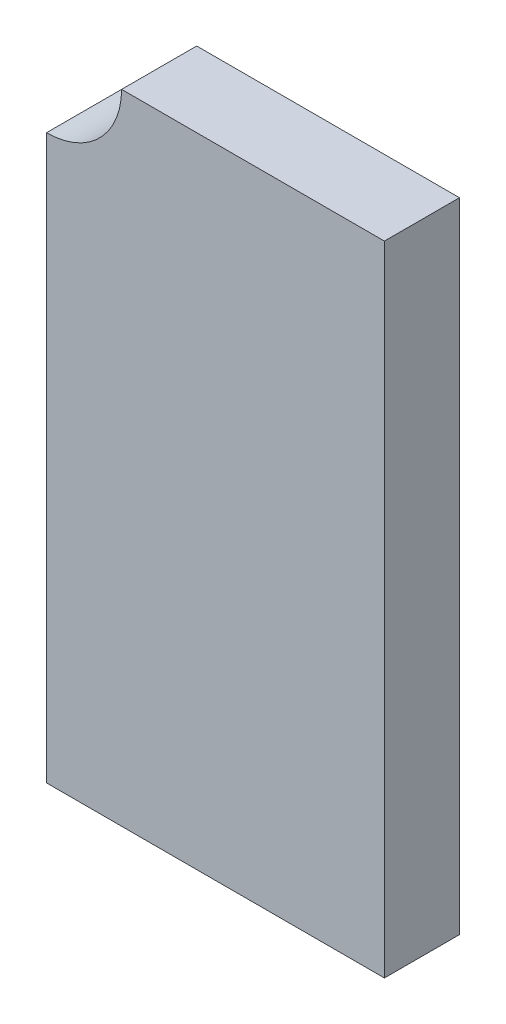
ISO-10303-21;
HEADER;
FILE_DESCRIPTION(('STEP AP214'),'2;1');
FILE_NAME('part.step','',(''),(''),'','','');
FILE_SCHEMA(('AUTOMOTIVE_DESIGN { 1 0 10303 214 1 1 1 1 }'));
ENDSEC;
DATA;
#1=APPLICATION_CONTEXT('core data for automotive mechanical design processes');
#2=APPLICATION_PROTOCOL_DEFINITION('international standard','automotive_design',2000,#1);
#3=PRODUCT_CONTEXT('',#1,'mechanical');
#4=PRODUCT('Part','Part','',(#3));
#5=PRODUCT_RELATED_PRODUCT_CATEGORY('part','',(#4));
#6=PRODUCT_DEFINITION_FORMATION('','',#4);
#7=PRODUCT_DEFINITION_CONTEXT('part definition',#1,'design');
#8=PRODUCT_DEFINITION('design','',#6,#7);
#9=PRODUCT_DEFINITION_SHAPE('','',#8);
#10=(LENGTH_UNIT() NAMED_UNIT(*) SI_UNIT(.MILLI.,.METRE.));
#11=(NAMED_UNIT(*) PLANE_ANGLE_UNIT() SI_UNIT($,.RADIAN.));
#12=(NAMED_UNIT(*) SI_UNIT($,.STERADIAN.) SOLID_ANGLE_UNIT());
#13=UNCERTAINTY_MEASURE_WITH_UNIT(LENGTH_MEASURE(1.E-05),#10,'distance_accuracy_value','');
#14=(GEOMETRIC_REPRESENTATION_CONTEXT(3) GLOBAL_UNCERTAINTY_ASSIGNED_CONTEXT((#13)) GLOBAL_UNIT_ASSIGNED_CONTEXT((#10,
#11,#12)) REPRESENTATION_CONTEXT('',''));
#15=CARTESIAN_POINT('',(0.,0.,0.));
#16=DIRECTION('',(0.,0.,1.));
#17=DIRECTION('',(1.,0.,0.));
#18=AXIS2_PLACEMENT_3D('',#15,#16,#17);
#19=CARTESIAN_POINT('',(-0.45,0.85,0.));
#20=DIRECTION('',(0.,0.,1.));
#21=DIRECTION('',(1.,0.,0.));
#22=AXIS2_PLACEMENT_3D('',#19,#20,#21);
#23=CYLINDRICAL_SURFACE('',#22,0.2);
#24=DIRECTION('',(0.,0.,1.));
#25=VECTOR('',#24,1.);
#26=CARTESIAN_POINT('',(-0.25,0.85,0.));
#27=LINE('',#26,#25);
#28=CARTESIAN_POINT('',(-0.25,0.85,0.));
#29=VERTEX_POINT('',#28);
#30=CARTESIAN_POINT('',(-0.25,0.85,0.2));
#31=VERTEX_POINT('',#30);
#32=EDGE_CURVE('E11',#29,#31,#27,.T.);
#33=ORIENTED_EDGE('',*,*,#32,.F.);
#34=CARTESIAN_POINT('',(-0.45,0.85,0.));
#35=DIRECTION('',(0.,0.,1.));
#36=DIRECTION('',(1.,0.,0.));
#37=AXIS2_PLACEMENT_3D('',#34,#35,#36);
#38=CIRCLE('',#37,0.2);
#39=CARTESIAN_POINT('',(-0.45,0.65,0.));
#40=VERTEX_POINT('',#39);
#41=EDGE_CURVE('E24',#40,#29,#38,.T.);
#42=ORIENTED_EDGE('',*,*,#41,.F.);
#43=DIRECTION('',(0.,0.,-1.));
#44=VECTOR('',#43,1.);
#45=CARTESIAN_POINT('',(-0.45,0.65,0.));
#46=LINE('',#45,#44);
#47=CARTESIAN_POINT('',(-0.45,0.65,0.2));
#48=VERTEX_POINT('',#47);
#49=EDGE_CURVE('E101',#48,#40,#46,.T.);
#50=ORIENTED_EDGE('',*,*,#49,.F.);
#51=CARTESIAN_POINT('',(-0.45,0.85,0.2));
#52=DIRECTION('',(0.,0.,-1.));
#53=DIRECTION('',(1.,0.,0.));
#54=AXIS2_PLACEMENT_3D('',#51,#52,#53);
#55=CIRCLE('',#54,0.2);
#56=EDGE_CURVE('E37',#31,#48,#55,.T.);
#57=ORIENTED_EDGE('',*,*,#56,.F.);
#58=EDGE_LOOP('',(#33,#42,#50,#57));
#59=FACE_BOUND('',#58,.T.);
#60=ADVANCED_FACE('F17',(#59),#23,.F.);
#61=CARTESIAN_POINT('',(0.,0.,0.2));
#62=DIRECTION('',(0.,0.,1.));
#63=DIRECTION('',(1.,0.,0.));
#64=AXIS2_PLACEMENT_3D('',#61,#62,#63);
#65=PLANE('',#64);
#66=ORIENTED_EDGE('',*,*,#56,.T.);
#67=DIRECTION('',(0.,-1.,0.));
#68=VECTOR('',#67,1.);
#69=CARTESIAN_POINT('',(-0.45,0.85,0.2));
#70=LINE('',#69,#68);
#71=CARTESIAN_POINT('',(-0.45,-0.85,0.2));
#72=VERTEX_POINT('',#71);
#73=EDGE_CURVE('E98',#48,#72,#70,.T.);
#74=ORIENTED_EDGE('',*,*,#73,.T.);
#75=DIRECTION('',(1.,0.,0.));
#76=VECTOR('',#75,1.);
#77=CARTESIAN_POINT('',(-0.45,-0.85,0.2));
#78=LINE('',#77,#76);
#79=CARTESIAN_POINT('',(0.45,-0.85,0.2));
#80=VERTEX_POINT('',#79);
#81=EDGE_CURVE('E96',#72,#80,#78,.T.);
#82=ORIENTED_EDGE('',*,*,#81,.T.);
#83=DIRECTION('',(0.,1.,0.));
#84=VECTOR('',#83,1.);
#85=CARTESIAN_POINT('',(0.45,-0.85,0.2));
#86=LINE('',#85,#84);
#87=CARTESIAN_POINT('',(0.45,0.85,0.2));
#88=VERTEX_POINT('',#87);
#89=EDGE_CURVE('E84',#80,#88,#86,.T.);
#90=ORIENTED_EDGE('',*,*,#89,.T.);
#91=DIRECTION('',(-1.,0.,0.));
#92=VECTOR('',#91,1.);
#93=CARTESIAN_POINT('',(0.45,0.85,0.2));
#94=LINE('',#93,#92);
#95=EDGE_CURVE('E92',#88,#31,#94,.T.);
#96=ORIENTED_EDGE('',*,*,#95,.T.);
#97=EDGE_LOOP('',(#66,#74,#82,#90,#96));
#98=FACE_BOUND('',#97,.T.);
#99=ADVANCED_FACE('F109',(#98),#65,.T.);
#100=CARTESIAN_POINT('',(-0.45,0.85,0.));
#101=DIRECTION('',(-1.,0.,0.));
#102=DIRECTION('',(0.,-1.,0.));
#103=AXIS2_PLACEMENT_3D('',#100,#101,#102);
#104=PLANE('',#103);
#105=ORIENTED_EDGE('',*,*,#49,.T.);
#106=DIRECTION('',(0.,-1.,0.));
#107=VECTOR('',#106,1.);
#108=CARTESIAN_POINT('',(-0.45,0.85,0.));
#109=LINE('',#108,#107);
#110=CARTESIAN_POINT('',(-0.45,-0.85,0.));
#111=VERTEX_POINT('',#110);
#112=EDGE_CURVE('E90',#40,#111,#109,.T.);
#113=ORIENTED_EDGE('',*,*,#112,.T.);
#114=DIRECTION('',(0.,0.,1.));
#115=VECTOR('',#114,1.);
#116=CARTESIAN_POINT('',(-0.45,-0.85,0.));
#117=LINE('',#116,#115);
#118=EDGE_CURVE('E79',#111,#72,#117,.T.);
#119=ORIENTED_EDGE('',*,*,#118,.T.);
#120=ORIENTED_EDGE('',*,*,#73,.F.);
#121=EDGE_LOOP('',(#105,#113,#119,#120));
#122=FACE_BOUND('',#121,.T.);
#123=ADVANCED_FACE('F104',(#122),#104,.T.);
#124=CARTESIAN_POINT('',(0.,0.,0.));
#125=DIRECTION('',(0.,0.,1.));
#126=DIRECTION('',(1.,0.,0.));
#127=AXIS2_PLACEMENT_3D('',#124,#125,#126);
#128=PLANE('',#127);
#129=ORIENTED_EDGE('',*,*,#41,.T.);
#130=DIRECTION('',(-1.,0.,0.));
#131=VECTOR('',#130,1.);
#132=CARTESIAN_POINT('',(0.45,0.85,0.));
#133=LINE('',#132,#131);
#134=CARTESIAN_POINT('',(0.45,0.85,0.));
#135=VERTEX_POINT('',#134);
#136=EDGE_CURVE('E66',#135,#29,#133,.T.);
#137=ORIENTED_EDGE('',*,*,#136,.F.);
#138=DIRECTION('',(0.,1.,0.));
#139=VECTOR('',#138,1.);
#140=CARTESIAN_POINT('',(0.45,-0.85,0.));
#141=LINE('',#140,#139);
#142=CARTESIAN_POINT('',(0.45,-0.85,0.));
#143=VERTEX_POINT('',#142);
#144=EDGE_CURVE('E61',#143,#135,#141,.T.);
#145=ORIENTED_EDGE('',*,*,#144,.F.);
#146=DIRECTION('',(1.,0.,0.));
#147=VECTOR('',#146,1.);
#148=CARTESIAN_POINT('',(-0.45,-0.85,0.));
#149=LINE('',#148,#147);
#150=EDGE_CURVE('E64',#111,#143,#149,.T.);
#151=ORIENTED_EDGE('',*,*,#150,.F.);
#152=ORIENTED_EDGE('',*,*,#112,.F.);
#153=EDGE_LOOP('',(#129,#137,#145,#151,#152));
#154=FACE_BOUND('',#153,.T.);
#155=ADVANCED_FACE('F63',(#154),#128,.F.);
#156=CARTESIAN_POINT('',(0.45,0.85,0.));
#157=DIRECTION('',(0.,1.,0.));
#158=DIRECTION('',(-1.,0.,0.));
#159=AXIS2_PLACEMENT_3D('',#156,#157,#158);
#160=PLANE('',#159);
#161=ORIENTED_EDGE('',*,*,#32,.T.);
#162=ORIENTED_EDGE('',*,*,#95,.F.);
#163=DIRECTION('',(0.,0.,1.));
#164=VECTOR('',#163,1.);
#165=CARTESIAN_POINT('',(0.45,0.85,0.));
#166=LINE('',#165,#164);
#167=EDGE_CURVE('E80',#135,#88,#166,.T.);
#168=ORIENTED_EDGE('',*,*,#167,.F.);
#169=ORIENTED_EDGE('',*,*,#136,.T.);
#170=EDGE_LOOP('',(#161,#162,#168,#169));
#171=FACE_BOUND('',#170,.T.);
#172=ADVANCED_FACE('F107',(#171),#160,.T.);
#173=CARTESIAN_POINT('',(0.45,-0.85,0.));
#174=DIRECTION('',(1.,0.,0.));
#175=DIRECTION('',(0.,1.,0.));
#176=AXIS2_PLACEMENT_3D('',#173,#174,#175);
#177=PLANE('',#176);
#178=ORIENTED_EDGE('',*,*,#144,.T.);
#179=ORIENTED_EDGE('',*,*,#167,.T.);
#180=ORIENTED_EDGE('',*,*,#89,.F.);
#181=DIRECTION('',(0.,0.,1.));
#182=VECTOR('',#181,1.);
#183=CARTESIAN_POINT('',(0.45,-0.85,0.));
#184=LINE('',#183,#182);
#185=EDGE_CURVE('E77',#143,#80,#184,.T.);
#186=ORIENTED_EDGE('',*,*,#185,.F.);
#187=EDGE_LOOP('',(#178,#179,#180,#186));
#188=FACE_BOUND('',#187,.T.);
#189=ADVANCED_FACE('F83',(#188),#177,.T.);
#190=CARTESIAN_POINT('',(-0.45,-0.85,0.));
#191=DIRECTION('',(0.,-1.,0.));
#192=DIRECTION('',(1.,0.,0.));
#193=AXIS2_PLACEMENT_3D('',#190,#191,#192);
#194=PLANE('',#193);
#195=ORIENTED_EDGE('',*,*,#150,.T.);
#196=ORIENTED_EDGE('',*,*,#185,.T.);
#197=ORIENTED_EDGE('',*,*,#81,.F.);
#198=ORIENTED_EDGE('',*,*,#118,.F.);
#199=EDGE_LOOP('',(#195,#196,#197,#198));
#200=FACE_BOUND('',#199,.T.);
#201=ADVANCED_FACE('F75',(#200),#194,.T.);
#202=CLOSED_SHELL('',(#60,#99,#123,#155,#172,#189,#201));
#203=MANIFOLD_SOLID_BREP('B1',#202);
#204=ADVANCED_BREP_SHAPE_REPRESENTATION('',(#18,#203),#14);
#205=SHAPE_DEFINITION_REPRESENTATION(#9,#204);
ENDSEC;
END-ISO-10303-21;
